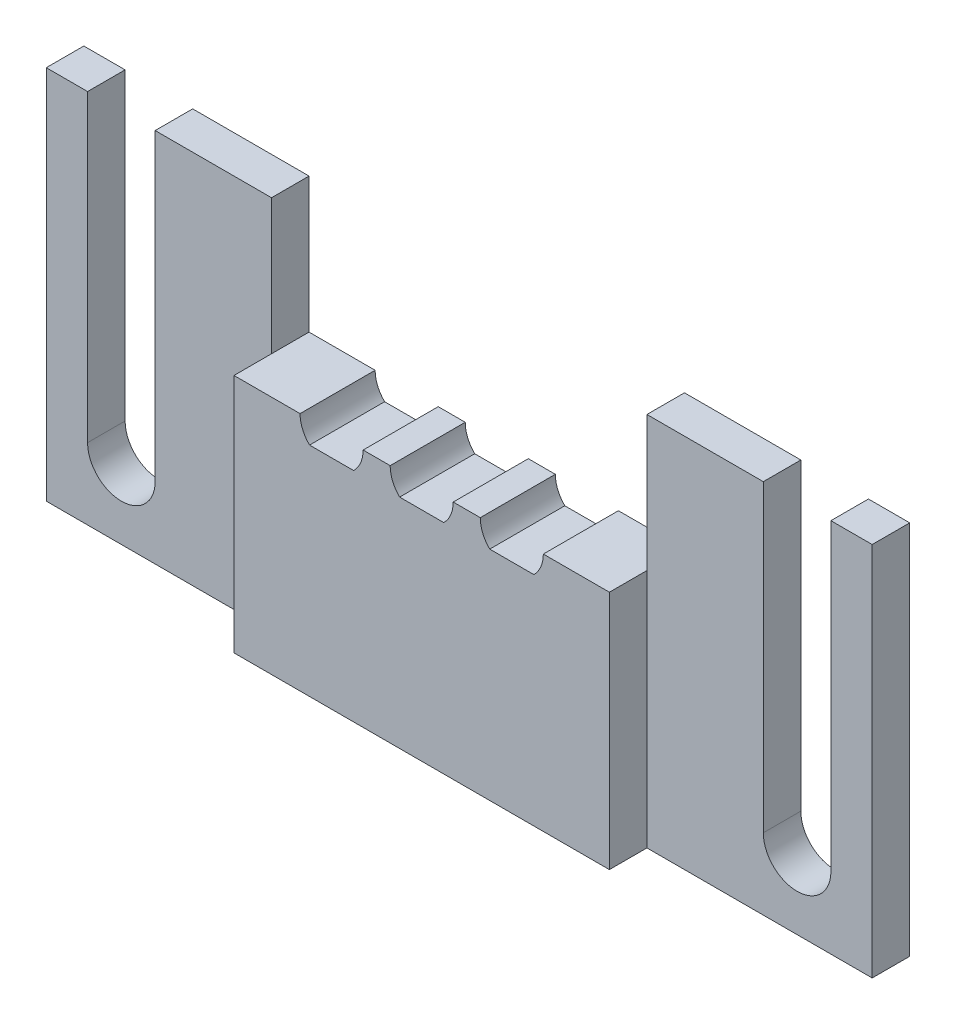
ISO-10303-21;
HEADER;
FILE_DESCRIPTION(('STEP AP214'),'2;1');
FILE_NAME('part.step','',(''),(''),'','','');
FILE_SCHEMA(('AUTOMOTIVE_DESIGN { 1 0 10303 214 1 1 1 1 }'));
ENDSEC;
DATA;
#1=APPLICATION_CONTEXT('core data for automotive mechanical design processes');
#2=APPLICATION_PROTOCOL_DEFINITION('international standard','automotive_design',2000,#1);
#3=PRODUCT_CONTEXT('',#1,'mechanical');
#4=PRODUCT('Part','Part','',(#3));
#5=PRODUCT_RELATED_PRODUCT_CATEGORY('part','',(#4));
#6=PRODUCT_DEFINITION_FORMATION('','',#4);
#7=PRODUCT_DEFINITION_CONTEXT('part definition',#1,'design');
#8=PRODUCT_DEFINITION('design','',#6,#7);
#9=PRODUCT_DEFINITION_SHAPE('','',#8);
#10=(LENGTH_UNIT() NAMED_UNIT(*) SI_UNIT(.MILLI.,.METRE.));
#11=(NAMED_UNIT(*) PLANE_ANGLE_UNIT() SI_UNIT($,.RADIAN.));
#12=(NAMED_UNIT(*) SI_UNIT($,.STERADIAN.) SOLID_ANGLE_UNIT());
#13=UNCERTAINTY_MEASURE_WITH_UNIT(LENGTH_MEASURE(1.E-05),#10,'distance_accuracy_value','');
#14=(GEOMETRIC_REPRESENTATION_CONTEXT(3) GLOBAL_UNCERTAINTY_ASSIGNED_CONTEXT((#13)) GLOBAL_UNIT_ASSIGNED_CONTEXT((#10,
#11,#12)) REPRESENTATION_CONTEXT('',''));
#15=CARTESIAN_POINT('',(0.,0.,0.));
#16=DIRECTION('',(0.,0.,1.));
#17=DIRECTION('',(1.,0.,0.));
#18=AXIS2_PLACEMENT_3D('',#15,#16,#17);
#19=CARTESIAN_POINT('',(-27.5,12.5,5.));
#20=DIRECTION('',(0.,-1.,0.));
#21=DIRECTION('',(0.,0.,-1.));
#22=AXIS2_PLACEMENT_3D('',#19,#20,#21);
#23=PLANE('',#22);
#24=DIRECTION('',(-1.,0.,0.));
#25=VECTOR('',#24,1.);
#26=CARTESIAN_POINT('',(12.5,12.5,2.5));
#27=LINE('',#26,#25);
#28=CARTESIAN_POINT('',(20.25,12.5,2.5));
#29=VERTEX_POINT('',#28);
#30=CARTESIAN_POINT('',(12.5,12.5,2.5));
#31=VERTEX_POINT('',#30);
#32=EDGE_CURVE('E438',#29,#31,#27,.T.);
#33=ORIENTED_EDGE('',*,*,#32,.F.);
#34=DIRECTION('',(0.,0.,-1.));
#35=VECTOR('',#34,1.);
#36=CARTESIAN_POINT('',(20.25,12.5,5.));
#37=LINE('',#36,#35);
#38=CARTESIAN_POINT('',(20.25,12.5,0.));
#39=VERTEX_POINT('',#38);
#40=EDGE_CURVE('E13',#29,#39,#37,.T.);
#41=ORIENTED_EDGE('',*,*,#40,.T.);
#42=DIRECTION('',(-1.,0.,0.));
#43=VECTOR('',#42,1.);
#44=CARTESIAN_POINT('',(-27.5,12.5,0.));
#45=LINE('',#44,#43);
#46=CARTESIAN_POINT('',(12.5,12.5,0.));
#47=VERTEX_POINT('',#46);
#48=EDGE_CURVE('E540',#39,#47,#45,.T.);
#49=ORIENTED_EDGE('',*,*,#48,.T.);
#50=DIRECTION('',(0.,0.,1.));
#51=VECTOR('',#50,1.);
#52=CARTESIAN_POINT('',(12.5,12.5,-5.));
#53=LINE('',#52,#51);
#54=EDGE_CURVE('E498',#47,#31,#53,.T.);
#55=ORIENTED_EDGE('',*,*,#54,.T.);
#56=EDGE_LOOP('',(#33,#41,#49,#55));
#57=FACE_BOUND('',#56,.T.);
#58=ADVANCED_FACE('F181',(#57),#23,.F.);
#59=CARTESIAN_POINT('',(0.,0.,0.));
#60=DIRECTION('',(0.,0.,1.));
#61=DIRECTION('',(1.,0.,0.));
#62=AXIS2_PLACEMENT_3D('',#59,#60,#61);
#63=PLANE('',#62);
#64=CARTESIAN_POINT('',(22.5,-7.75,0.));
#65=DIRECTION('',(0.,0.,1.));
#66=DIRECTION('',(1.,0.,0.));
#67=AXIS2_PLACEMENT_3D('',#64,#65,#66);
#68=CIRCLE('',#67,2.24999999999999);
#69=CARTESIAN_POINT('',(20.25,-7.75,0.));
#70=VERTEX_POINT('',#69);
#71=CARTESIAN_POINT('',(24.75,-7.75,0.));
#72=VERTEX_POINT('',#71);
#73=EDGE_CURVE('E398',#70,#72,#68,.T.);
#74=ORIENTED_EDGE('',*,*,#73,.T.);
#75=DIRECTION('',(0.,1.,0.));
#76=VECTOR('',#75,1.);
#77=CARTESIAN_POINT('',(24.75,-7.75,0.));
#78=LINE('',#77,#76);
#79=CARTESIAN_POINT('',(24.75,12.5,0.));
#80=VERTEX_POINT('',#79);
#81=EDGE_CURVE('E384',#72,#80,#78,.T.);
#82=ORIENTED_EDGE('',*,*,#81,.T.);
#83=CARTESIAN_POINT('',(27.5,12.5,0.));
#84=VERTEX_POINT('',#83);
#85=EDGE_CURVE('E537',#84,#80,#45,.T.);
#86=ORIENTED_EDGE('',*,*,#85,.F.);
#87=DIRECTION('',(0.,1.,0.));
#88=VECTOR('',#87,1.);
#89=CARTESIAN_POINT('',(27.5,12.5,0.));
#90=LINE('',#89,#88);
#91=CARTESIAN_POINT('',(27.5,-12.5,0.));
#92=VERTEX_POINT('',#91);
#93=EDGE_CURVE('E493',#92,#84,#90,.T.);
#94=ORIENTED_EDGE('',*,*,#93,.F.);
#95=DIRECTION('',(1.,0.,0.));
#96=VECTOR('',#95,1.);
#97=CARTESIAN_POINT('',(-27.5,-12.5,0.));
#98=LINE('',#97,#96);
#99=CARTESIAN_POINT('',(-27.5,-12.5,0.));
#100=VERTEX_POINT('',#99);
#101=EDGE_CURVE('E533',#100,#92,#98,.T.);
#102=ORIENTED_EDGE('',*,*,#101,.F.);
#103=DIRECTION('',(0.,-1.,0.));
#104=VECTOR('',#103,1.);
#105=CARTESIAN_POINT('',(-27.5,12.5,0.));
#106=LINE('',#105,#104);
#107=CARTESIAN_POINT('',(-27.5,12.5,0.));
#108=VERTEX_POINT('',#107);
#109=EDGE_CURVE('E539',#108,#100,#106,.T.);
#110=ORIENTED_EDGE('',*,*,#109,.F.);
#111=CARTESIAN_POINT('',(-24.75,12.5,0.));
#112=VERTEX_POINT('',#111);
#113=EDGE_CURVE('E536',#112,#108,#45,.T.);
#114=ORIENTED_EDGE('',*,*,#113,.F.);
#115=DIRECTION('',(0.,1.,0.));
#116=VECTOR('',#115,1.);
#117=CARTESIAN_POINT('',(-24.75,-7.75,0.));
#118=LINE('',#117,#116);
#119=CARTESIAN_POINT('',(-24.75,-7.75,0.));
#120=VERTEX_POINT('',#119);
#121=EDGE_CURVE('E415',#120,#112,#118,.T.);
#122=ORIENTED_EDGE('',*,*,#121,.F.);
#123=CARTESIAN_POINT('',(-22.5,-7.75,0.));
#124=DIRECTION('',(0.,0.,1.));
#125=DIRECTION('',(1.,0.,0.));
#126=AXIS2_PLACEMENT_3D('',#123,#124,#125);
#127=CIRCLE('',#126,2.24999999999999);
#128=CARTESIAN_POINT('',(-20.25,-7.75,0.));
#129=VERTEX_POINT('',#128);
#130=EDGE_CURVE('E425',#120,#129,#127,.T.);
#131=ORIENTED_EDGE('',*,*,#130,.T.);
#132=DIRECTION('',(0.,1.,0.));
#133=VECTOR('',#132,1.);
#134=CARTESIAN_POINT('',(-20.25,-7.75,0.));
#135=LINE('',#134,#133);
#136=CARTESIAN_POINT('',(-20.25,12.5,0.));
#137=VERTEX_POINT('',#136);
#138=EDGE_CURVE('E412',#129,#137,#135,.T.);
#139=ORIENTED_EDGE('',*,*,#138,.T.);
#140=CARTESIAN_POINT('',(-12.5,12.5,0.));
#141=VERTEX_POINT('',#140);
#142=EDGE_CURVE('E541',#141,#137,#45,.T.);
#143=ORIENTED_EDGE('',*,*,#142,.F.);
#144=DIRECTION('',(0.,-1.,0.));
#145=VECTOR('',#144,1.);
#146=CARTESIAN_POINT('',(-12.5,0.,0.));
#147=LINE('',#146,#145);
#148=CARTESIAN_POINT('',(-12.5,3.50000000000001,0.));
#149=VERTEX_POINT('',#148);
#150=EDGE_CURVE('E595',#141,#149,#147,.T.);
#151=ORIENTED_EDGE('',*,*,#150,.T.);
#152=DIRECTION('',(1.,0.,0.));
#153=VECTOR('',#152,1.);
#154=CARTESIAN_POINT('',(0.,3.50000000000001,0.));
#155=LINE('',#154,#153);
#156=CARTESIAN_POINT('',(-8.1,3.50000000000001,0.));
#157=VERTEX_POINT('',#156);
#158=EDGE_CURVE('E592',#149,#157,#155,.T.);
#159=ORIENTED_EDGE('',*,*,#158,.T.);
#160=CARTESIAN_POINT('',(-6.,3.49999999999997,0.));
#161=DIRECTION('',(0.,0.,1.));
#162=DIRECTION('',(1.,0.,0.));
#163=AXIS2_PLACEMENT_3D('',#160,#161,#162);
#164=CIRCLE('',#163,2.1);
#165=CARTESIAN_POINT('',(-7.46969384566995,2.00000000000001,0.));
#166=VERTEX_POINT('',#165);
#167=EDGE_CURVE('E554',#157,#166,#164,.T.);
#168=ORIENTED_EDGE('',*,*,#167,.T.);
#169=DIRECTION('',(1.,0.,0.));
#170=VECTOR('',#169,1.);
#171=CARTESIAN_POINT('',(0.,2.00000000000001,0.));
#172=LINE('',#171,#170);
#173=CARTESIAN_POINT('',(-4.53030615433005,2.00000000000001,0.));
#174=VERTEX_POINT('',#173);
#175=EDGE_CURVE('E557',#166,#174,#172,.T.);
#176=ORIENTED_EDGE('',*,*,#175,.T.);
#177=CARTESIAN_POINT('',(-6.,3.49999999999997,0.));
#178=DIRECTION('',(0.,0.,1.));
#179=DIRECTION('',(1.,0.,0.));
#180=AXIS2_PLACEMENT_3D('',#177,#178,#179);
#181=CIRCLE('',#180,2.1);
#182=CARTESIAN_POINT('',(-3.9,3.50000000000001,0.));
#183=VERTEX_POINT('',#182);
#184=EDGE_CURVE('E560',#174,#183,#181,.T.);
#185=ORIENTED_EDGE('',*,*,#184,.T.);
#186=DIRECTION('',(1.,0.,0.));
#187=VECTOR('',#186,1.);
#188=CARTESIAN_POINT('',(0.,3.50000000000001,0.));
#189=LINE('',#188,#187);
#190=CARTESIAN_POINT('',(-2.1,3.50000000000001,0.));
#191=VERTEX_POINT('',#190);
#192=EDGE_CURVE('E563',#183,#191,#189,.T.);
#193=ORIENTED_EDGE('',*,*,#192,.T.);
#194=CARTESIAN_POINT('',(0.,3.50000000000001,0.));
#195=DIRECTION('',(0.,0.,1.));
#196=DIRECTION('',(1.,0.,0.));
#197=AXIS2_PLACEMENT_3D('',#194,#195,#196);
#198=CIRCLE('',#197,2.1);
#199=CARTESIAN_POINT('',(-1.46969384566991,2.00000000000001,0.));
#200=VERTEX_POINT('',#199);
#201=EDGE_CURVE('E566',#191,#200,#198,.T.);
#202=ORIENTED_EDGE('',*,*,#201,.T.);
#203=DIRECTION('',(1.,0.,0.));
#204=VECTOR('',#203,1.);
#205=CARTESIAN_POINT('',(0.,2.00000000000001,0.));
#206=LINE('',#205,#204);
#207=CARTESIAN_POINT('',(1.46969384566991,2.00000000000001,0.));
#208=VERTEX_POINT('',#207);
#209=EDGE_CURVE('E569',#200,#208,#206,.T.);
#210=ORIENTED_EDGE('',*,*,#209,.T.);
#211=CARTESIAN_POINT('',(0.,3.50000000000001,0.));
#212=DIRECTION('',(0.,0.,1.));
#213=DIRECTION('',(1.,0.,0.));
#214=AXIS2_PLACEMENT_3D('',#211,#212,#213);
#215=CIRCLE('',#214,2.1);
#216=CARTESIAN_POINT('',(2.1,3.50000000000001,0.));
#217=VERTEX_POINT('',#216);
#218=EDGE_CURVE('E572',#208,#217,#215,.T.);
#219=ORIENTED_EDGE('',*,*,#218,.T.);
#220=DIRECTION('',(1.,0.,0.));
#221=VECTOR('',#220,1.);
#222=CARTESIAN_POINT('',(0.,3.50000000000001,0.));
#223=LINE('',#222,#221);
#224=CARTESIAN_POINT('',(3.9,3.50000000000001,0.));
#225=VERTEX_POINT('',#224);
#226=EDGE_CURVE('E575',#217,#225,#223,.T.);
#227=ORIENTED_EDGE('',*,*,#226,.T.);
#228=CARTESIAN_POINT('',(6.,3.50000000000009,0.));
#229=DIRECTION('',(0.,0.,1.));
#230=DIRECTION('',(1.,0.,0.));
#231=AXIS2_PLACEMENT_3D('',#228,#229,#230);
#232=CIRCLE('',#231,2.1);
#233=CARTESIAN_POINT('',(4.53030615433018,2.00000000000001,0.));
#234=VERTEX_POINT('',#233);
#235=EDGE_CURVE('E578',#225,#234,#232,.T.);
#236=ORIENTED_EDGE('',*,*,#235,.T.);
#237=DIRECTION('',(1.,0.,0.));
#238=VECTOR('',#237,1.);
#239=CARTESIAN_POINT('',(0.,2.00000000000001,0.));
#240=LINE('',#239,#238);
#241=CARTESIAN_POINT('',(7.46969384566982,2.00000000000001,0.));
#242=VERTEX_POINT('',#241);
#243=EDGE_CURVE('E581',#234,#242,#240,.T.);
#244=ORIENTED_EDGE('',*,*,#243,.T.);
#245=CARTESIAN_POINT('',(6.,3.50000000000009,0.));
#246=DIRECTION('',(0.,0.,1.));
#247=DIRECTION('',(1.,0.,0.));
#248=AXIS2_PLACEMENT_3D('',#245,#246,#247);
#249=CIRCLE('',#248,2.1);
#250=CARTESIAN_POINT('',(8.1,3.50000000000001,0.));
#251=VERTEX_POINT('',#250);
#252=EDGE_CURVE('E584',#242,#251,#249,.T.);
#253=ORIENTED_EDGE('',*,*,#252,.T.);
#254=DIRECTION('',(1.,0.,0.));
#255=VECTOR('',#254,1.);
#256=CARTESIAN_POINT('',(0.,3.50000000000001,0.));
#257=LINE('',#256,#255);
#258=CARTESIAN_POINT('',(12.5,3.50000000000001,0.));
#259=VERTEX_POINT('',#258);
#260=EDGE_CURVE('E587',#251,#259,#257,.T.);
#261=ORIENTED_EDGE('',*,*,#260,.T.);
#262=DIRECTION('',(0.,-1.,0.));
#263=VECTOR('',#262,1.);
#264=CARTESIAN_POINT('',(12.5,0.,0.));
#265=LINE('',#264,#263);
#266=EDGE_CURVE('E590',#47,#259,#265,.T.);
#267=ORIENTED_EDGE('',*,*,#266,.F.);
#268=ORIENTED_EDGE('',*,*,#48,.F.);
#269=DIRECTION('',(0.,1.,0.));
#270=VECTOR('',#269,1.);
#271=CARTESIAN_POINT('',(20.25,-7.75,0.));
#272=LINE('',#271,#270);
#273=EDGE_CURVE('E392',#70,#39,#272,.T.);
#274=ORIENTED_EDGE('',*,*,#273,.F.);
#275=EDGE_LOOP('',(#74,#82,#86,#94,#102,#110,#114,#122,#131,#139,#143,#151,#159,#168,#176,#185,
#193,#202,#210,#219,#227,#236,#244,#253,#261,#267,#268,#274));
#276=FACE_BOUND('',#275,.T.);
#277=ADVANCED_FACE('F404',(#276),#63,.F.);
#278=DIRECTION('',(-1.,0.,0.));
#279=VECTOR('',#278,1.);
#280=CARTESIAN_POINT('',(-27.5,12.5,2.5));
#281=LINE('',#280,#279);
#282=CARTESIAN_POINT('',(-24.75,12.5,2.5));
#283=VERTEX_POINT('',#282);
#284=CARTESIAN_POINT('',(-27.5,12.5,2.5));
#285=VERTEX_POINT('',#284);
#286=EDGE_CURVE('E454',#283,#285,#281,.T.);
#287=ORIENTED_EDGE('',*,*,#286,.F.);
#288=DIRECTION('',(0.,0.,-1.));
#289=VECTOR('',#288,1.);
#290=CARTESIAN_POINT('',(-24.75,12.5,5.));
#291=LINE('',#290,#289);
#292=EDGE_CURVE('E602',#283,#112,#291,.T.);
#293=ORIENTED_EDGE('',*,*,#292,.T.);
#294=ORIENTED_EDGE('',*,*,#113,.T.);
#295=DIRECTION('',(0.,0.,-1.));
#296=VECTOR('',#295,1.);
#297=CARTESIAN_POINT('',(-27.5,12.5,5.));
#298=LINE('',#297,#296);
#299=EDGE_CURVE('E549',#285,#108,#298,.T.);
#300=ORIENTED_EDGE('',*,*,#299,.F.);
#301=EDGE_LOOP('',(#287,#293,#294,#300));
#302=FACE_BOUND('',#301,.T.);
#303=ADVANCED_FACE('F629',(#302),#23,.F.);
#304=ORIENTED_EDGE('',*,*,#85,.T.);
#305=DIRECTION('',(0.,0.,1.));
#306=VECTOR('',#305,1.);
#307=CARTESIAN_POINT('',(24.75,12.5,5.));
#308=LINE('',#307,#306);
#309=CARTESIAN_POINT('',(24.75,12.5,2.5));
#310=VERTEX_POINT('',#309);
#311=EDGE_CURVE('E189',#80,#310,#308,.T.);
#312=ORIENTED_EDGE('',*,*,#311,.T.);
#313=CARTESIAN_POINT('',(27.5,12.5,2.5));
#314=VERTEX_POINT('',#313);
#315=EDGE_CURVE('E439',#314,#310,#27,.T.);
#316=ORIENTED_EDGE('',*,*,#315,.F.);
#317=DIRECTION('',(0.,0.,-1.));
#318=VECTOR('',#317,1.);
#319=CARTESIAN_POINT('',(27.5,12.5,5.));
#320=LINE('',#319,#318);
#321=EDGE_CURVE('E552',#314,#84,#320,.T.);
#322=ORIENTED_EDGE('',*,*,#321,.T.);
#323=EDGE_LOOP('',(#304,#312,#316,#322));
#324=FACE_BOUND('',#323,.T.);
#325=ADVANCED_FACE('F606',(#324),#23,.F.);
#326=CARTESIAN_POINT('',(27.5,12.5,5.));
#327=DIRECTION('',(-1.,0.,0.));
#328=DIRECTION('',(0.,-1.,0.));
#329=AXIS2_PLACEMENT_3D('',#326,#327,#328);
#330=PLANE('',#329);
#331=DIRECTION('',(0.,1.,0.));
#332=VECTOR('',#331,1.);
#333=CARTESIAN_POINT('',(27.5,12.5,2.5));
#334=LINE('',#333,#332);
#335=CARTESIAN_POINT('',(27.5,-12.5,2.5));
#336=VERTEX_POINT('',#335);
#337=EDGE_CURVE('E436',#336,#314,#334,.T.);
#338=ORIENTED_EDGE('',*,*,#337,.F.);
#339=DIRECTION('',(0.,0.,-1.));
#340=VECTOR('',#339,1.);
#341=CARTESIAN_POINT('',(27.5,-12.5,5.));
#342=LINE('',#341,#340);
#343=EDGE_CURVE('E532',#336,#92,#342,.T.);
#344=ORIENTED_EDGE('',*,*,#343,.T.);
#345=ORIENTED_EDGE('',*,*,#93,.T.);
#346=ORIENTED_EDGE('',*,*,#321,.F.);
#347=EDGE_LOOP('',(#338,#344,#345,#346));
#348=FACE_BOUND('',#347,.T.);
#349=ADVANCED_FACE('F183',(#348),#330,.F.);
#350=CARTESIAN_POINT('',(12.5,0.,-5.));
#351=DIRECTION('',(-1.,0.,0.));
#352=DIRECTION('',(0.,0.,1.));
#353=AXIS2_PLACEMENT_3D('',#350,#351,#352);
#354=PLANE('',#353);
#355=DIRECTION('',(0.,0.,1.));
#356=VECTOR('',#355,1.);
#357=CARTESIAN_POINT('',(12.5,3.50000000000001,-5.));
#358=LINE('',#357,#356);
#359=CARTESIAN_POINT('',(12.5,3.50000000000001,2.5));
#360=VERTEX_POINT('',#359);
#361=EDGE_CURVE('E501',#259,#360,#358,.T.);
#362=ORIENTED_EDGE('',*,*,#361,.T.);
#363=DIRECTION('',(0.,-1.,0.));
#364=VECTOR('',#363,1.);
#365=CARTESIAN_POINT('',(12.5,12.5,2.5));
#366=LINE('',#365,#364);
#367=EDGE_CURVE('E431',#31,#360,#366,.T.);
#368=ORIENTED_EDGE('',*,*,#367,.F.);
#369=ORIENTED_EDGE('',*,*,#54,.F.);
#370=ORIENTED_EDGE('',*,*,#266,.T.);
#371=EDGE_LOOP('',(#362,#368,#369,#370));
#372=FACE_BOUND('',#371,.T.);
#373=ADVANCED_FACE('F637',(#372),#354,.T.);
#374=ORIENTED_EDGE('',*,*,#142,.T.);
#375=DIRECTION('',(0.,0.,1.));
#376=VECTOR('',#375,1.);
#377=CARTESIAN_POINT('',(-20.25,12.5,5.));
#378=LINE('',#377,#376);
#379=CARTESIAN_POINT('',(-20.25,12.5,2.5));
#380=VERTEX_POINT('',#379);
#381=EDGE_CURVE('E600',#137,#380,#378,.T.);
#382=ORIENTED_EDGE('',*,*,#381,.T.);
#383=CARTESIAN_POINT('',(-12.5,12.5,2.5));
#384=VERTEX_POINT('',#383);
#385=EDGE_CURVE('E455',#384,#380,#281,.T.);
#386=ORIENTED_EDGE('',*,*,#385,.F.);
#387=DIRECTION('',(0.,0.,1.));
#388=VECTOR('',#387,1.);
#389=CARTESIAN_POINT('',(-12.5,12.5,-5.));
#390=LINE('',#389,#388);
#391=EDGE_CURVE('E495',#141,#384,#390,.T.);
#392=ORIENTED_EDGE('',*,*,#391,.F.);
#393=EDGE_LOOP('',(#374,#382,#386,#392));
#394=FACE_BOUND('',#393,.T.);
#395=ADVANCED_FACE('F701',(#394),#23,.F.);
#396=CARTESIAN_POINT('',(-27.5,12.5,5.));
#397=DIRECTION('',(1.,0.,0.));
#398=DIRECTION('',(0.,0.,-1.));
#399=AXIS2_PLACEMENT_3D('',#396,#397,#398);
#400=PLANE('',#399);
#401=DIRECTION('',(0.,-1.,0.));
#402=VECTOR('',#401,1.);
#403=CARTESIAN_POINT('',(-27.5,12.5,2.5));
#404=LINE('',#403,#402);
#405=CARTESIAN_POINT('',(-27.5,-12.5,2.5));
#406=VERTEX_POINT('',#405);
#407=EDGE_CURVE('E447',#285,#406,#404,.T.);
#408=ORIENTED_EDGE('',*,*,#407,.F.);
#409=ORIENTED_EDGE('',*,*,#299,.T.);
#410=ORIENTED_EDGE('',*,*,#109,.T.);
#411=DIRECTION('',(0.,0.,-1.));
#412=VECTOR('',#411,1.);
#413=CARTESIAN_POINT('',(-27.5,-12.5,5.));
#414=LINE('',#413,#412);
#415=EDGE_CURVE('E547',#406,#100,#414,.T.);
#416=ORIENTED_EDGE('',*,*,#415,.F.);
#417=EDGE_LOOP('',(#408,#409,#410,#416));
#418=FACE_BOUND('',#417,.T.);
#419=ADVANCED_FACE('F625',(#418),#400,.F.);
#420=CARTESIAN_POINT('',(-12.5,0.,-5.));
#421=DIRECTION('',(-1.,0.,0.));
#422=DIRECTION('',(0.,0.,1.));
#423=AXIS2_PLACEMENT_3D('',#420,#421,#422);
#424=PLANE('',#423);
#425=DIRECTION('',(0.,1.,0.));
#426=VECTOR('',#425,1.);
#427=CARTESIAN_POINT('',(-12.5,0.,2.5));
#428=LINE('',#427,#426);
#429=CARTESIAN_POINT('',(-12.5,3.50000000000001,2.5));
#430=VERTEX_POINT('',#429);
#431=EDGE_CURVE('E598',#430,#384,#428,.T.);
#432=ORIENTED_EDGE('',*,*,#431,.F.);
#433=DIRECTION('',(0.,0.,1.));
#434=VECTOR('',#433,1.);
#435=CARTESIAN_POINT('',(-12.5,3.50000000000001,-5.));
#436=LINE('',#435,#434);
#437=EDGE_CURVE('E490',#149,#430,#436,.T.);
#438=ORIENTED_EDGE('',*,*,#437,.F.);
#439=ORIENTED_EDGE('',*,*,#150,.F.);
#440=ORIENTED_EDGE('',*,*,#391,.T.);
#441=EDGE_LOOP('',(#432,#438,#439,#440));
#442=FACE_BOUND('',#441,.T.);
#443=ADVANCED_FACE('F695',(#442),#424,.F.);
#444=CARTESIAN_POINT('',(-27.5,-12.5,5.));
#445=DIRECTION('',(0.,1.,0.));
#446=DIRECTION('',(0.,0.,1.));
#447=AXIS2_PLACEMENT_3D('',#444,#445,#446);
#448=PLANE('',#447);
#449=DIRECTION('',(1.,0.,0.));
#450=VECTOR('',#449,1.);
#451=CARTESIAN_POINT('',(12.5,-12.5,2.5));
#452=LINE('',#451,#450);
#453=CARTESIAN_POINT('',(12.5,-12.5,2.5));
#454=VERTEX_POINT('',#453);
#455=EDGE_CURVE('E433',#454,#336,#452,.T.);
#456=ORIENTED_EDGE('',*,*,#455,.F.);
#457=DIRECTION('',(0.,0.,1.));
#458=VECTOR('',#457,1.);
#459=CARTESIAN_POINT('',(12.5,-12.5,2.5));
#460=LINE('',#459,#458);
#461=CARTESIAN_POINT('',(12.5,-12.5,5.));
#462=VERTEX_POINT('',#461);
#463=EDGE_CURVE('E442',#454,#462,#460,.T.);
#464=ORIENTED_EDGE('',*,*,#463,.T.);
#465=DIRECTION('',(1.,0.,0.));
#466=VECTOR('',#465,1.);
#467=CARTESIAN_POINT('',(-27.5,-12.5,5.));
#468=LINE('',#467,#466);
#469=CARTESIAN_POINT('',(-12.5,-12.5,5.));
#470=VERTEX_POINT('',#469);
#471=EDGE_CURVE('E529',#470,#462,#468,.T.);
#472=ORIENTED_EDGE('',*,*,#471,.F.);
#473=DIRECTION('',(0.,0.,1.));
#474=VECTOR('',#473,1.);
#475=CARTESIAN_POINT('',(-12.5,-12.5,2.5));
#476=LINE('',#475,#474);
#477=CARTESIAN_POINT('',(-12.5,-12.5,2.5));
#478=VERTEX_POINT('',#477);
#479=EDGE_CURVE('E458',#478,#470,#476,.T.);
#480=ORIENTED_EDGE('',*,*,#479,.F.);
#481=DIRECTION('',(1.,0.,0.));
#482=VECTOR('',#481,1.);
#483=CARTESIAN_POINT('',(-27.5,-12.5,2.5));
#484=LINE('',#483,#482);
#485=EDGE_CURVE('E449',#406,#478,#484,.T.);
#486=ORIENTED_EDGE('',*,*,#485,.F.);
#487=ORIENTED_EDGE('',*,*,#415,.T.);
#488=ORIENTED_EDGE('',*,*,#101,.T.);
#489=ORIENTED_EDGE('',*,*,#343,.F.);
#490=EDGE_LOOP('',(#456,#464,#472,#480,#486,#487,#488,#489));
#491=FACE_BOUND('',#490,.T.);
#492=ADVANCED_FACE('F615',(#491),#448,.F.);
#493=CARTESIAN_POINT('',(0.,0.,5.));
#494=DIRECTION('',(0.,0.,1.));
#495=DIRECTION('',(1.,0.,0.));
#496=AXIS2_PLACEMENT_3D('',#493,#494,#495);
#497=PLANE('',#496);
#498=DIRECTION('',(0.,-1.,0.));
#499=VECTOR('',#498,1.);
#500=CARTESIAN_POINT('',(12.5,12.5,5.));
#501=LINE('',#500,#499);
#502=CARTESIAN_POINT('',(12.5,3.50000000000001,5.));
#503=VERTEX_POINT('',#502);
#504=EDGE_CURVE('E430',#503,#462,#501,.T.);
#505=ORIENTED_EDGE('',*,*,#504,.F.);
#506=DIRECTION('',(1.,0.,0.));
#507=VECTOR('',#506,1.);
#508=CARTESIAN_POINT('',(0.,3.50000000000001,5.));
#509=LINE('',#508,#507);
#510=CARTESIAN_POINT('',(8.1,3.50000000000001,5.));
#511=VERTEX_POINT('',#510);
#512=EDGE_CURVE('E465',#511,#503,#509,.T.);
#513=ORIENTED_EDGE('',*,*,#512,.F.);
#514=CARTESIAN_POINT('',(6.,3.50000000000009,5.));
#515=DIRECTION('',(0.,0.,1.));
#516=DIRECTION('',(1.,0.,0.));
#517=AXIS2_PLACEMENT_3D('',#514,#515,#516);
#518=CIRCLE('',#517,2.1);
#519=CARTESIAN_POINT('',(7.46969384566982,2.00000000000001,5.));
#520=VERTEX_POINT('',#519);
#521=EDGE_CURVE('E487',#520,#511,#518,.T.);
#522=ORIENTED_EDGE('',*,*,#521,.F.);
#523=DIRECTION('',(1.,0.,0.));
#524=VECTOR('',#523,1.);
#525=CARTESIAN_POINT('',(0.,2.00000000000001,5.));
#526=LINE('',#525,#524);
#527=CARTESIAN_POINT('',(4.53030615433018,2.00000000000001,5.));
#528=VERTEX_POINT('',#527);
#529=EDGE_CURVE('E486',#528,#520,#526,.T.);
#530=ORIENTED_EDGE('',*,*,#529,.F.);
#531=CARTESIAN_POINT('',(3.9,3.50000000000001,5.));
#532=VERTEX_POINT('',#531);
#533=EDGE_CURVE('E483',#532,#528,#518,.T.);
#534=ORIENTED_EDGE('',*,*,#533,.F.);
#535=CARTESIAN_POINT('',(2.1,3.50000000000001,5.));
#536=VERTEX_POINT('',#535);
#537=EDGE_CURVE('E482',#536,#532,#509,.T.);
#538=ORIENTED_EDGE('',*,*,#537,.F.);
#539=CARTESIAN_POINT('',(0.,3.50000000000001,5.));
#540=DIRECTION('',(0.,0.,1.));
#541=DIRECTION('',(1.,0.,0.));
#542=AXIS2_PLACEMENT_3D('',#539,#540,#541);
#543=CIRCLE('',#542,2.1);
#544=CARTESIAN_POINT('',(1.46969384566991,2.00000000000001,5.));
#545=VERTEX_POINT('',#544);
#546=EDGE_CURVE('E479',#545,#536,#543,.T.);
#547=ORIENTED_EDGE('',*,*,#546,.F.);
#548=DIRECTION('',(1.,0.,0.));
#549=VECTOR('',#548,1.);
#550=CARTESIAN_POINT('',(0.,2.00000000000001,5.));
#551=LINE('',#550,#549);
#552=CARTESIAN_POINT('',(-1.46969384566991,2.00000000000001,5.));
#553=VERTEX_POINT('',#552);
#554=EDGE_CURVE('E476',#553,#545,#551,.T.);
#555=ORIENTED_EDGE('',*,*,#554,.F.);
#556=CARTESIAN_POINT('',(0.,3.50000000000001,5.));
#557=DIRECTION('',(0.,0.,1.));
#558=DIRECTION('',(1.,0.,0.));
#559=AXIS2_PLACEMENT_3D('',#556,#557,#558);
#560=CIRCLE('',#559,2.1);
#561=CARTESIAN_POINT('',(-2.1,3.50000000000001,5.));
#562=VERTEX_POINT('',#561);
#563=EDGE_CURVE('E473',#562,#553,#560,.T.);
#564=ORIENTED_EDGE('',*,*,#563,.F.);
#565=CARTESIAN_POINT('',(-3.9,3.50000000000001,5.));
#566=VERTEX_POINT('',#565);
#567=EDGE_CURVE('E466',#566,#562,#509,.T.);
#568=ORIENTED_EDGE('',*,*,#567,.F.);
#569=CARTESIAN_POINT('',(-6.,3.49999999999997,5.));
#570=DIRECTION('',(0.,0.,1.));
#571=DIRECTION('',(1.,0.,0.));
#572=AXIS2_PLACEMENT_3D('',#569,#570,#571);
#573=CIRCLE('',#572,2.1);
#574=CARTESIAN_POINT('',(-4.53030615433005,2.00000000000001,5.));
#575=VERTEX_POINT('',#574);
#576=EDGE_CURVE('E470',#575,#566,#573,.T.);
#577=ORIENTED_EDGE('',*,*,#576,.F.);
#578=DIRECTION('',(1.,0.,0.));
#579=VECTOR('',#578,1.);
#580=CARTESIAN_POINT('',(0.,2.00000000000001,5.));
#581=LINE('',#580,#579);
#582=CARTESIAN_POINT('',(-7.46969384566995,2.00000000000001,5.));
#583=VERTEX_POINT('',#582);
#584=EDGE_CURVE('E469',#583,#575,#581,.T.);
#585=ORIENTED_EDGE('',*,*,#584,.F.);
#586=CARTESIAN_POINT('',(-8.1,3.50000000000001,5.));
#587=VERTEX_POINT('',#586);
#588=EDGE_CURVE('E464',#587,#583,#573,.T.);
#589=ORIENTED_EDGE('',*,*,#588,.F.);
#590=CARTESIAN_POINT('',(-12.5,3.50000000000001,5.));
#591=VERTEX_POINT('',#590);
#592=EDGE_CURVE('E461',#591,#587,#509,.T.);
#593=ORIENTED_EDGE('',*,*,#592,.F.);
#594=DIRECTION('',(0.,1.,0.));
#595=VECTOR('',#594,1.);
#596=CARTESIAN_POINT('',(-12.5,12.5,5.));
#597=LINE('',#596,#595);
#598=EDGE_CURVE('E446',#470,#591,#597,.T.);
#599=ORIENTED_EDGE('',*,*,#598,.F.);
#600=ORIENTED_EDGE('',*,*,#471,.T.);
#601=EDGE_LOOP('',(#505,#513,#522,#530,#534,#538,#547,#555,#564,#568,#577,#585,#589,#593,#599,#600));
#602=FACE_BOUND('',#601,.T.);
#603=ADVANCED_FACE('F653',(#602),#497,.T.);
#604=CARTESIAN_POINT('',(0.,3.50000000000001,-5.));
#605=DIRECTION('',(0.,-1.,0.));
#606=DIRECTION('',(0.,0.,-1.));
#607=AXIS2_PLACEMENT_3D('',#604,#605,#606);
#608=PLANE('',#607);
#609=ORIENTED_EDGE('',*,*,#437,.T.);
#610=EDGE_CURVE('E494',#430,#591,#436,.T.);
#611=ORIENTED_EDGE('',*,*,#610,.T.);
#612=ORIENTED_EDGE('',*,*,#592,.T.);
#613=DIRECTION('',(0.,0.,1.));
#614=VECTOR('',#613,1.);
#615=CARTESIAN_POINT('',(-8.1,3.50000000000001,-5.));
#616=LINE('',#615,#614);
#617=EDGE_CURVE('E527',#157,#587,#616,.T.);
#618=ORIENTED_EDGE('',*,*,#617,.F.);
#619=ORIENTED_EDGE('',*,*,#158,.F.);
#620=EDGE_LOOP('',(#609,#611,#612,#618,#619));
#621=FACE_BOUND('',#620,.T.);
#622=ADVANCED_FACE('F688',(#621),#608,.F.);
#623=DIRECTION('',(0.,0.,1.));
#624=VECTOR('',#623,1.);
#625=CARTESIAN_POINT('',(8.1,3.50000000000001,-5.));
#626=LINE('',#625,#624);
#627=EDGE_CURVE('E505',#251,#511,#626,.T.);
#628=ORIENTED_EDGE('',*,*,#627,.T.);
#629=ORIENTED_EDGE('',*,*,#512,.T.);
#630=EDGE_CURVE('E504',#360,#503,#358,.T.);
#631=ORIENTED_EDGE('',*,*,#630,.F.);
#632=ORIENTED_EDGE('',*,*,#361,.F.);
#633=ORIENTED_EDGE('',*,*,#260,.F.);
#634=EDGE_LOOP('',(#628,#629,#631,#632,#633));
#635=FACE_BOUND('',#634,.T.);
#636=ADVANCED_FACE('F641',(#635),#608,.F.);
#637=CARTESIAN_POINT('',(6.,3.50000000000009,-5.));
#638=DIRECTION('',(0.,0.,1.));
#639=DIRECTION('',(1.,0.,0.));
#640=AXIS2_PLACEMENT_3D('',#637,#638,#639);
#641=CYLINDRICAL_SURFACE('',#640,2.1);
#642=DIRECTION('',(0.,0.,1.));
#643=VECTOR('',#642,1.);
#644=CARTESIAN_POINT('',(7.46969384566982,2.00000000000001,-5.));
#645=LINE('',#644,#643);
#646=EDGE_CURVE('E507',#242,#520,#645,.T.);
#647=ORIENTED_EDGE('',*,*,#646,.T.);
#648=ORIENTED_EDGE('',*,*,#521,.T.);
#649=ORIENTED_EDGE('',*,*,#627,.F.);
#650=ORIENTED_EDGE('',*,*,#252,.F.);
#651=EDGE_LOOP('',(#647,#648,#649,#650));
#652=FACE_BOUND('',#651,.T.);
#653=ADVANCED_FACE('F646',(#652),#641,.F.);
#654=CARTESIAN_POINT('',(0.,2.00000000000001,-5.));
#655=DIRECTION('',(0.,-1.,0.));
#656=DIRECTION('',(0.,0.,-1.));
#657=AXIS2_PLACEMENT_3D('',#654,#655,#656);
#658=PLANE('',#657);
#659=DIRECTION('',(0.,0.,1.));
#660=VECTOR('',#659,1.);
#661=CARTESIAN_POINT('',(4.53030615433018,2.00000000000001,-5.));
#662=LINE('',#661,#660);
#663=EDGE_CURVE('E509',#234,#528,#662,.T.);
#664=ORIENTED_EDGE('',*,*,#663,.T.);
#665=ORIENTED_EDGE('',*,*,#529,.T.);
#666=ORIENTED_EDGE('',*,*,#646,.F.);
#667=ORIENTED_EDGE('',*,*,#243,.F.);
#668=EDGE_LOOP('',(#664,#665,#666,#667));
#669=FACE_BOUND('',#668,.T.);
#670=ADVANCED_FACE('F907',(#669),#658,.F.);
#671=DIRECTION('',(0.,0.,1.));
#672=VECTOR('',#671,1.);
#673=CARTESIAN_POINT('',(3.9,3.50000000000001,-5.));
#674=LINE('',#673,#672);
#675=EDGE_CURVE('E511',#225,#532,#674,.T.);
#676=ORIENTED_EDGE('',*,*,#675,.T.);
#677=ORIENTED_EDGE('',*,*,#533,.T.);
#678=ORIENTED_EDGE('',*,*,#663,.F.);
#679=ORIENTED_EDGE('',*,*,#235,.F.);
#680=EDGE_LOOP('',(#676,#677,#678,#679));
#681=FACE_BOUND('',#680,.T.);
#682=ADVANCED_FACE('F908',(#681),#641,.F.);
#683=DIRECTION('',(0.,0.,1.));
#684=VECTOR('',#683,1.);
#685=CARTESIAN_POINT('',(2.1,3.50000000000001,-5.));
#686=LINE('',#685,#684);
#687=EDGE_CURVE('E513',#217,#536,#686,.T.);
#688=ORIENTED_EDGE('',*,*,#687,.T.);
#689=ORIENTED_EDGE('',*,*,#537,.T.);
#690=ORIENTED_EDGE('',*,*,#675,.F.);
#691=ORIENTED_EDGE('',*,*,#226,.F.);
#692=EDGE_LOOP('',(#688,#689,#690,#691));
#693=FACE_BOUND('',#692,.T.);
#694=ADVANCED_FACE('F794',(#693),#608,.F.);
#695=CARTESIAN_POINT('',(0.,3.50000000000001,-5.));
#696=DIRECTION('',(0.,0.,1.));
#697=DIRECTION('',(1.,0.,0.));
#698=AXIS2_PLACEMENT_3D('',#695,#696,#697);
#699=CYLINDRICAL_SURFACE('',#698,2.1);
#700=DIRECTION('',(0.,0.,1.));
#701=VECTOR('',#700,1.);
#702=CARTESIAN_POINT('',(1.46969384566991,2.00000000000001,-5.));
#703=LINE('',#702,#701);
#704=EDGE_CURVE('E515',#208,#545,#703,.T.);
#705=ORIENTED_EDGE('',*,*,#704,.T.);
#706=ORIENTED_EDGE('',*,*,#546,.T.);
#707=ORIENTED_EDGE('',*,*,#687,.F.);
#708=ORIENTED_EDGE('',*,*,#218,.F.);
#709=EDGE_LOOP('',(#705,#706,#707,#708));
#710=FACE_BOUND('',#709,.T.);
#711=ADVANCED_FACE('F912',(#710),#699,.F.);
#712=CARTESIAN_POINT('',(0.,2.00000000000001,-5.));
#713=DIRECTION('',(0.,-1.,0.));
#714=DIRECTION('',(0.,0.,-1.));
#715=AXIS2_PLACEMENT_3D('',#712,#713,#714);
#716=PLANE('',#715);
#717=DIRECTION('',(0.,0.,1.));
#718=VECTOR('',#717,1.);
#719=CARTESIAN_POINT('',(-1.46969384566991,2.00000000000001,-5.));
#720=LINE('',#719,#718);
#721=EDGE_CURVE('E517',#200,#553,#720,.T.);
#722=ORIENTED_EDGE('',*,*,#721,.T.);
#723=ORIENTED_EDGE('',*,*,#554,.T.);
#724=ORIENTED_EDGE('',*,*,#704,.F.);
#725=ORIENTED_EDGE('',*,*,#209,.F.);
#726=EDGE_LOOP('',(#722,#723,#724,#725));
#727=FACE_BOUND('',#726,.T.);
#728=ADVANCED_FACE('F915',(#727),#716,.F.);
#729=CARTESIAN_POINT('',(0.,3.50000000000001,-5.));
#730=DIRECTION('',(0.,0.,1.));
#731=DIRECTION('',(1.,0.,0.));
#732=AXIS2_PLACEMENT_3D('',#729,#730,#731);
#733=CYLINDRICAL_SURFACE('',#732,2.1);
#734=DIRECTION('',(0.,0.,1.));
#735=VECTOR('',#734,1.);
#736=CARTESIAN_POINT('',(-2.1,3.50000000000001,-5.));
#737=LINE('',#736,#735);
#738=EDGE_CURVE('E519',#191,#562,#737,.T.);
#739=ORIENTED_EDGE('',*,*,#738,.T.);
#740=ORIENTED_EDGE('',*,*,#563,.T.);
#741=ORIENTED_EDGE('',*,*,#721,.F.);
#742=ORIENTED_EDGE('',*,*,#201,.F.);
#743=EDGE_LOOP('',(#739,#740,#741,#742));
#744=FACE_BOUND('',#743,.T.);
#745=ADVANCED_FACE('F675',(#744),#733,.F.);
#746=DIRECTION('',(0.,0.,1.));
#747=VECTOR('',#746,1.);
#748=CARTESIAN_POINT('',(-3.9,3.50000000000001,-5.));
#749=LINE('',#748,#747);
#750=EDGE_CURVE('E521',#183,#566,#749,.T.);
#751=ORIENTED_EDGE('',*,*,#750,.T.);
#752=ORIENTED_EDGE('',*,*,#567,.T.);
#753=ORIENTED_EDGE('',*,*,#738,.F.);
#754=ORIENTED_EDGE('',*,*,#192,.F.);
#755=EDGE_LOOP('',(#751,#752,#753,#754));
#756=FACE_BOUND('',#755,.T.);
#757=ADVANCED_FACE('F676',(#756),#608,.F.);
#758=CARTESIAN_POINT('',(-6.,3.49999999999997,-5.));
#759=DIRECTION('',(0.,0.,1.));
#760=DIRECTION('',(1.,0.,0.));
#761=AXIS2_PLACEMENT_3D('',#758,#759,#760);
#762=CYLINDRICAL_SURFACE('',#761,2.1);
#763=DIRECTION('',(0.,0.,1.));
#764=VECTOR('',#763,1.);
#765=CARTESIAN_POINT('',(-4.53030615433005,2.00000000000001,-5.));
#766=LINE('',#765,#764);
#767=EDGE_CURVE('E523',#174,#575,#766,.T.);
#768=ORIENTED_EDGE('',*,*,#767,.T.);
#769=ORIENTED_EDGE('',*,*,#576,.T.);
#770=ORIENTED_EDGE('',*,*,#750,.F.);
#771=ORIENTED_EDGE('',*,*,#184,.F.);
#772=EDGE_LOOP('',(#768,#769,#770,#771));
#773=FACE_BOUND('',#772,.T.);
#774=ADVANCED_FACE('F668',(#773),#762,.F.);
#775=CARTESIAN_POINT('',(0.,2.00000000000001,-5.));
#776=DIRECTION('',(0.,-1.,0.));
#777=DIRECTION('',(0.,0.,-1.));
#778=AXIS2_PLACEMENT_3D('',#775,#776,#777);
#779=PLANE('',#778);
#780=DIRECTION('',(0.,0.,1.));
#781=VECTOR('',#780,1.);
#782=CARTESIAN_POINT('',(-7.46969384566995,2.00000000000001,-5.));
#783=LINE('',#782,#781);
#784=EDGE_CURVE('E525',#166,#583,#783,.T.);
#785=ORIENTED_EDGE('',*,*,#784,.T.);
#786=ORIENTED_EDGE('',*,*,#584,.T.);
#787=ORIENTED_EDGE('',*,*,#767,.F.);
#788=ORIENTED_EDGE('',*,*,#175,.F.);
#789=EDGE_LOOP('',(#785,#786,#787,#788));
#790=FACE_BOUND('',#789,.T.);
#791=ADVANCED_FACE('F679',(#790),#779,.F.);
#792=ORIENTED_EDGE('',*,*,#617,.T.);
#793=ORIENTED_EDGE('',*,*,#588,.T.);
#794=ORIENTED_EDGE('',*,*,#784,.F.);
#795=ORIENTED_EDGE('',*,*,#167,.F.);
#796=EDGE_LOOP('',(#792,#793,#794,#795));
#797=FACE_BOUND('',#796,.T.);
#798=ADVANCED_FACE('F684',(#797),#762,.F.);
#799=CARTESIAN_POINT('',(-12.5,12.5,2.5));
#800=DIRECTION('',(1.,0.,0.));
#801=DIRECTION('',(0.,0.,-1.));
#802=AXIS2_PLACEMENT_3D('',#799,#800,#801);
#803=PLANE('',#802);
#804=DIRECTION('',(0.,1.,0.));
#805=VECTOR('',#804,1.);
#806=CARTESIAN_POINT('',(-12.5,12.5,2.5));
#807=LINE('',#806,#805);
#808=EDGE_CURVE('E452',#478,#430,#807,.T.);
#809=ORIENTED_EDGE('',*,*,#808,.F.);
#810=ORIENTED_EDGE('',*,*,#479,.T.);
#811=ORIENTED_EDGE('',*,*,#598,.T.);
#812=ORIENTED_EDGE('',*,*,#610,.F.);
#813=EDGE_LOOP('',(#809,#810,#811,#812));
#814=FACE_BOUND('',#813,.T.);
#815=ADVANCED_FACE('F693',(#814),#803,.F.);
#816=CARTESIAN_POINT('',(0.,0.,2.5));
#817=DIRECTION('',(0.,0.,1.));
#818=DIRECTION('',(1.,0.,0.));
#819=AXIS2_PLACEMENT_3D('',#816,#817,#818);
#820=PLANE('',#819);
#821=DIRECTION('',(0.,1.,0.));
#822=VECTOR('',#821,1.);
#823=CARTESIAN_POINT('',(-20.2500000000001,-7.75,2.5));
#824=LINE('',#823,#822);
#825=CARTESIAN_POINT('',(-20.25,-7.75,2.5));
#826=VERTEX_POINT('',#825);
#827=EDGE_CURVE('E204',#826,#380,#824,.T.);
#828=ORIENTED_EDGE('',*,*,#827,.F.);
#829=CARTESIAN_POINT('',(-22.5,-7.75,2.5));
#830=DIRECTION('',(0.,0.,1.));
#831=DIRECTION('',(1.,0.,0.));
#832=AXIS2_PLACEMENT_3D('',#829,#830,#831);
#833=CIRCLE('',#832,2.24999999999999);
#834=CARTESIAN_POINT('',(-24.75,-7.75,2.5));
#835=VERTEX_POINT('',#834);
#836=EDGE_CURVE('E423',#835,#826,#833,.T.);
#837=ORIENTED_EDGE('',*,*,#836,.F.);
#838=DIRECTION('',(0.,1.,0.));
#839=VECTOR('',#838,1.);
#840=CARTESIAN_POINT('',(-24.75,-7.75,2.5));
#841=LINE('',#840,#839);
#842=EDGE_CURVE('E417',#835,#283,#841,.T.);
#843=ORIENTED_EDGE('',*,*,#842,.T.);
#844=ORIENTED_EDGE('',*,*,#286,.T.);
#845=ORIENTED_EDGE('',*,*,#407,.T.);
#846=ORIENTED_EDGE('',*,*,#485,.T.);
#847=ORIENTED_EDGE('',*,*,#808,.T.);
#848=ORIENTED_EDGE('',*,*,#431,.T.);
#849=ORIENTED_EDGE('',*,*,#385,.T.);
#850=EDGE_LOOP('',(#828,#837,#843,#844,#845,#846,#847,#848,#849));
#851=FACE_BOUND('',#850,.T.);
#852=ADVANCED_FACE('F699',(#851),#820,.T.);
#853=CARTESIAN_POINT('',(12.5,12.5,2.5));
#854=DIRECTION('',(-1.,0.,0.));
#855=DIRECTION('',(0.,0.,1.));
#856=AXIS2_PLACEMENT_3D('',#853,#854,#855);
#857=PLANE('',#856);
#858=ORIENTED_EDGE('',*,*,#504,.T.);
#859=ORIENTED_EDGE('',*,*,#463,.F.);
#860=EDGE_CURVE('E434',#360,#454,#366,.T.);
#861=ORIENTED_EDGE('',*,*,#860,.F.);
#862=ORIENTED_EDGE('',*,*,#630,.T.);
#863=EDGE_LOOP('',(#858,#859,#861,#862));
#864=FACE_BOUND('',#863,.T.);
#865=ADVANCED_FACE('F718',(#864),#857,.F.);
#866=CARTESIAN_POINT('',(0.,0.,2.5));
#867=DIRECTION('',(0.,0.,1.));
#868=DIRECTION('',(1.,0.,0.));
#869=AXIS2_PLACEMENT_3D('',#866,#867,#868);
#870=PLANE('',#869);
#871=DIRECTION('',(0.,1.,0.));
#872=VECTOR('',#871,1.);
#873=CARTESIAN_POINT('',(24.75,-7.75,2.5));
#874=LINE('',#873,#872);
#875=CARTESIAN_POINT('',(24.75,-7.75,2.5));
#876=VERTEX_POINT('',#875);
#877=EDGE_CURVE('E196',#876,#310,#874,.T.);
#878=ORIENTED_EDGE('',*,*,#877,.F.);
#879=CARTESIAN_POINT('',(22.5,-7.75,2.5));
#880=DIRECTION('',(0.,0.,1.));
#881=DIRECTION('',(1.,0.,0.));
#882=AXIS2_PLACEMENT_3D('',#879,#880,#881);
#883=CIRCLE('',#882,2.24999999999999);
#884=CARTESIAN_POINT('',(20.2500000000001,-7.75,2.5));
#885=VERTEX_POINT('',#884);
#886=EDGE_CURVE('E401',#885,#876,#883,.T.);
#887=ORIENTED_EDGE('',*,*,#886,.F.);
#888=DIRECTION('',(0.,1.,0.));
#889=VECTOR('',#888,1.);
#890=CARTESIAN_POINT('',(20.25,-7.75,2.5));
#891=LINE('',#890,#889);
#892=EDGE_CURVE('E402',#885,#29,#891,.T.);
#893=ORIENTED_EDGE('',*,*,#892,.T.);
#894=ORIENTED_EDGE('',*,*,#32,.T.);
#895=ORIENTED_EDGE('',*,*,#367,.T.);
#896=ORIENTED_EDGE('',*,*,#860,.T.);
#897=ORIENTED_EDGE('',*,*,#455,.T.);
#898=ORIENTED_EDGE('',*,*,#337,.T.);
#899=ORIENTED_EDGE('',*,*,#315,.T.);
#900=EDGE_LOOP('',(#878,#887,#893,#894,#895,#896,#897,#898,#899));
#901=FACE_BOUND('',#900,.T.);
#902=ADVANCED_FACE('F609',(#901),#870,.T.);
#903=CARTESIAN_POINT('',(-24.75,-7.75,2.5));
#904=DIRECTION('',(-1.,0.,0.));
#905=DIRECTION('',(0.,0.,1.));
#906=AXIS2_PLACEMENT_3D('',#903,#904,#905);
#907=PLANE('',#906);
#908=ORIENTED_EDGE('',*,*,#842,.F.);
#909=DIRECTION('',(0.,0.,1.));
#910=VECTOR('',#909,1.);
#911=CARTESIAN_POINT('',(-24.75,-7.75,2.5));
#912=LINE('',#911,#910);
#913=EDGE_CURVE('E428',#835,#120,#912,.F.);
#914=ORIENTED_EDGE('',*,*,#913,.T.);
#915=ORIENTED_EDGE('',*,*,#121,.T.);
#916=ORIENTED_EDGE('',*,*,#292,.F.);
#917=EDGE_LOOP('',(#908,#914,#915,#916));
#918=FACE_BOUND('',#917,.T.);
#919=ADVANCED_FACE('F710',(#918),#907,.F.);
#920=CARTESIAN_POINT('',(-20.25,-7.75,0.));
#921=DIRECTION('',(1.,0.,0.));
#922=DIRECTION('',(0.,0.,-1.));
#923=AXIS2_PLACEMENT_3D('',#920,#921,#922);
#924=PLANE('',#923);
#925=ORIENTED_EDGE('',*,*,#138,.F.);
#926=DIRECTION('',(0.,0.,-1.));
#927=VECTOR('',#926,1.);
#928=CARTESIAN_POINT('',(-20.25,-7.75,0.));
#929=LINE('',#928,#927);
#930=EDGE_CURVE('E420',#826,#129,#929,.T.);
#931=ORIENTED_EDGE('',*,*,#930,.F.);
#932=ORIENTED_EDGE('',*,*,#827,.T.);
#933=ORIENTED_EDGE('',*,*,#381,.F.);
#934=EDGE_LOOP('',(#925,#931,#932,#933));
#935=FACE_BOUND('',#934,.T.);
#936=ADVANCED_FACE('F703',(#935),#924,.F.);
#937=CARTESIAN_POINT('',(-22.5,-7.75,2.5));
#938=DIRECTION('',(0.,0.,1.));
#939=DIRECTION('',(1.,0.,0.));
#940=AXIS2_PLACEMENT_3D('',#937,#938,#939);
#941=CYLINDRICAL_SURFACE('',#940,2.24999999999999);
#942=ORIENTED_EDGE('',*,*,#836,.T.);
#943=ORIENTED_EDGE('',*,*,#930,.T.);
#944=ORIENTED_EDGE('',*,*,#130,.F.);
#945=ORIENTED_EDGE('',*,*,#913,.F.);
#946=EDGE_LOOP('',(#942,#943,#944,#945));
#947=FACE_BOUND('',#946,.T.);
#948=ADVANCED_FACE('F707',(#947),#941,.F.);
#949=CARTESIAN_POINT('',(20.25,-7.75,2.5));
#950=DIRECTION('',(-1.,0.,0.));
#951=DIRECTION('',(0.,0.,1.));
#952=AXIS2_PLACEMENT_3D('',#949,#950,#951);
#953=PLANE('',#952);
#954=ORIENTED_EDGE('',*,*,#892,.F.);
#955=DIRECTION('',(0.,0.,1.));
#956=VECTOR('',#955,1.);
#957=CARTESIAN_POINT('',(20.25,-7.75,2.5));
#958=LINE('',#957,#956);
#959=EDGE_CURVE('E406',#885,#70,#958,.F.);
#960=ORIENTED_EDGE('',*,*,#959,.T.);
#961=ORIENTED_EDGE('',*,*,#273,.T.);
#962=ORIENTED_EDGE('',*,*,#40,.F.);
#963=EDGE_LOOP('',(#954,#960,#961,#962));
#964=FACE_BOUND('',#963,.T.);
#965=ADVANCED_FACE('F869',(#964),#953,.F.);
#966=CARTESIAN_POINT('',(24.75,-7.75,0.));
#967=DIRECTION('',(1.,0.,0.));
#968=DIRECTION('',(0.,0.,-1.));
#969=AXIS2_PLACEMENT_3D('',#966,#967,#968);
#970=PLANE('',#969);
#971=ORIENTED_EDGE('',*,*,#81,.F.);
#972=DIRECTION('',(0.,0.,-1.));
#973=VECTOR('',#972,1.);
#974=CARTESIAN_POINT('',(24.75,-7.75,0.));
#975=LINE('',#974,#973);
#976=EDGE_CURVE('E387',#876,#72,#975,.T.);
#977=ORIENTED_EDGE('',*,*,#976,.F.);
#978=ORIENTED_EDGE('',*,*,#877,.T.);
#979=ORIENTED_EDGE('',*,*,#311,.F.);
#980=EDGE_LOOP('',(#971,#977,#978,#979));
#981=FACE_BOUND('',#980,.T.);
#982=ADVANCED_FACE('F386',(#981),#970,.F.);
#983=CARTESIAN_POINT('',(22.5,-7.75,2.5));
#984=DIRECTION('',(0.,0.,1.));
#985=DIRECTION('',(1.,0.,0.));
#986=AXIS2_PLACEMENT_3D('',#983,#984,#985);
#987=CYLINDRICAL_SURFACE('',#986,2.24999999999999);
#988=ORIENTED_EDGE('',*,*,#886,.T.);
#989=ORIENTED_EDGE('',*,*,#976,.T.);
#990=ORIENTED_EDGE('',*,*,#73,.F.);
#991=ORIENTED_EDGE('',*,*,#959,.F.);
#992=EDGE_LOOP('',(#988,#989,#990,#991));
#993=FACE_BOUND('',#992,.T.);
#994=ADVANCED_FACE('F396',(#993),#987,.F.);
#995=CLOSED_SHELL('',(#58,#277,#303,#325,#349,#373,#395,#419,#443,#492,#603,#622,#636,#653,#670,
#682,#694,#711,#728,#745,#757,#774,#791,#798,#815,#852,#865,#902,#919,#936,#948,#965,#982,#994));
#996=MANIFOLD_SOLID_BREP('B2',#995);
#997=ADVANCED_BREP_SHAPE_REPRESENTATION('',(#18,#996),#14);
#998=SHAPE_DEFINITION_REPRESENTATION(#9,#997);
ENDSEC;
END-ISO-10303-21;
